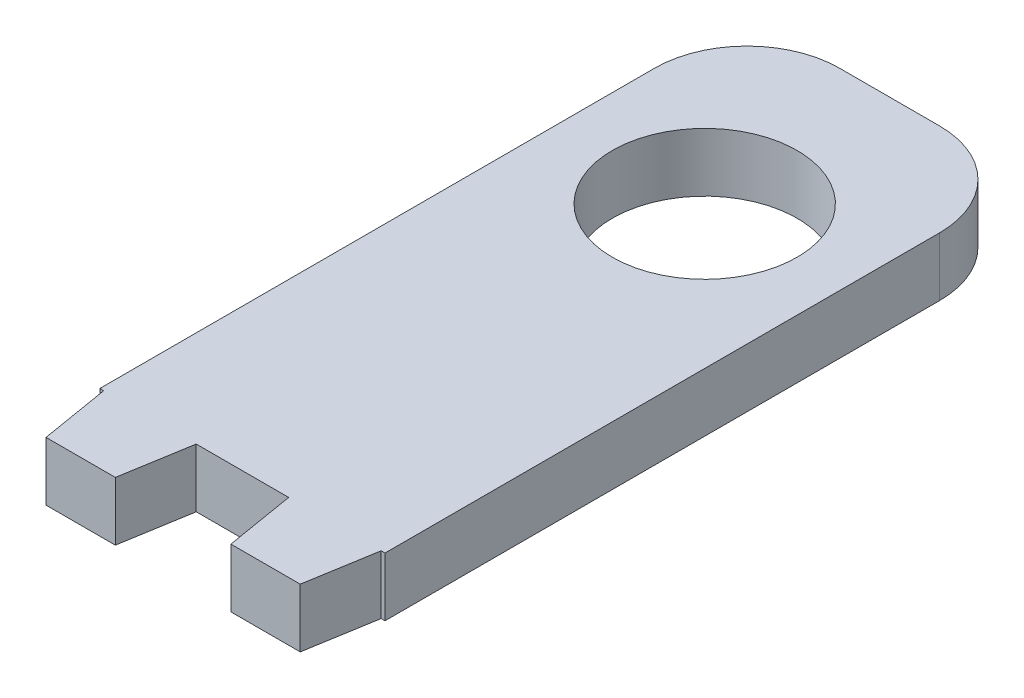
ISO-10303-21;
HEADER;
FILE_DESCRIPTION(('STEP AP214'),'2;1');
FILE_NAME('part.step','',(''),(''),'','','');
FILE_SCHEMA(('AUTOMOTIVE_DESIGN { 1 0 10303 214 1 1 1 1 }'));
ENDSEC;
DATA;
#1=APPLICATION_CONTEXT('core data for automotive mechanical design processes');
#2=APPLICATION_PROTOCOL_DEFINITION('international standard','automotive_design',2000,#1);
#3=PRODUCT_CONTEXT('',#1,'mechanical');
#4=PRODUCT('Part','Part','',(#3));
#5=PRODUCT_RELATED_PRODUCT_CATEGORY('part','',(#4));
#6=PRODUCT_DEFINITION_FORMATION('','',#4);
#7=PRODUCT_DEFINITION_CONTEXT('part definition',#1,'design');
#8=PRODUCT_DEFINITION('design','',#6,#7);
#9=PRODUCT_DEFINITION_SHAPE('','',#8);
#10=(LENGTH_UNIT() NAMED_UNIT(*) SI_UNIT(.MILLI.,.METRE.));
#11=(NAMED_UNIT(*) PLANE_ANGLE_UNIT() SI_UNIT($,.RADIAN.));
#12=(NAMED_UNIT(*) SI_UNIT($,.STERADIAN.) SOLID_ANGLE_UNIT());
#13=UNCERTAINTY_MEASURE_WITH_UNIT(LENGTH_MEASURE(1.E-05),#10,'distance_accuracy_value','');
#14=(GEOMETRIC_REPRESENTATION_CONTEXT(3) GLOBAL_UNCERTAINTY_ASSIGNED_CONTEXT((#13)) GLOBAL_UNIT_ASSIGNED_CONTEXT((#10,
#11,#12)) REPRESENTATION_CONTEXT('',''));
#15=CARTESIAN_POINT('',(0.,0.,0.));
#16=DIRECTION('',(0.,0.,1.));
#17=DIRECTION('',(1.,0.,0.));
#18=AXIS2_PLACEMENT_3D('',#15,#16,#17);
#19=CARTESIAN_POINT('',(20.2702702702703,6.35,3.37837837837838));
#20=DIRECTION('',(0.986393923832144,0.,0.164398987305357));
#21=DIRECTION('',(0.164398987305357,0.,-0.986393923832144));
#22=AXIS2_PLACEMENT_3D('',#19,#20,#21);
#23=PLANE('',#22);
#24=DIRECTION('',(-0.164398987305357,0.,0.986393923832144));
#25=VECTOR('',#24,1.);
#26=CARTESIAN_POINT('',(20.2702702702703,0.,3.37837837837838));
#27=LINE('',#26,#25);
#28=CARTESIAN_POINT('',(15.,0.,35.));
#29=VERTEX_POINT('',#28);
#30=CARTESIAN_POINT('',(13.75,0.,42.5));
#31=VERTEX_POINT('',#30);
#32=EDGE_CURVE('E141',#29,#31,#27,.T.);
#33=ORIENTED_EDGE('',*,*,#32,.F.);
#34=DIRECTION('',(0.,-1.,0.));
#35=VECTOR('',#34,1.);
#36=CARTESIAN_POINT('',(15.,6.35,35.));
#37=LINE('',#36,#35);
#38=CARTESIAN_POINT('',(15.,6.35,35.));
#39=VERTEX_POINT('',#38);
#40=EDGE_CURVE('E135',#39,#29,#37,.T.);
#41=ORIENTED_EDGE('',*,*,#40,.F.);
#42=DIRECTION('',(-0.164398987305357,0.,0.986393923832144));
#43=VECTOR('',#42,1.);
#44=CARTESIAN_POINT('',(20.2702702702703,6.35,3.37837837837838));
#45=LINE('',#44,#43);
#46=CARTESIAN_POINT('',(13.75,6.35,42.5));
#47=VERTEX_POINT('',#46);
#48=EDGE_CURVE('E138',#39,#47,#45,.T.);
#49=ORIENTED_EDGE('',*,*,#48,.T.);
#50=DIRECTION('',(0.,-1.,0.));
#51=VECTOR('',#50,1.);
#52=CARTESIAN_POINT('',(13.75,6.35,42.5));
#53=LINE('',#52,#51);
#54=EDGE_CURVE('E185',#47,#31,#53,.T.);
#55=ORIENTED_EDGE('',*,*,#54,.T.);
#56=EDGE_LOOP('',(#33,#41,#49,#55));
#57=FACE_BOUND('',#56,.T.);
#58=ADVANCED_FACE('F34',(#57),#23,.T.);
#59=CARTESIAN_POINT('',(0.,6.35,35.));
#60=DIRECTION('',(0.,0.,-1.));
#61=DIRECTION('',(-1.,0.,0.));
#62=AXIS2_PLACEMENT_3D('',#59,#60,#61);
#63=PLANE('',#62);
#64=DIRECTION('',(1.,0.,0.));
#65=VECTOR('',#64,1.);
#66=CARTESIAN_POINT('',(0.,0.,35.));
#67=LINE('',#66,#65);
#68=CARTESIAN_POINT('',(15.4183643849684,0.,35.));
#69=VERTEX_POINT('',#68);
#70=EDGE_CURVE('E187',#29,#69,#67,.T.);
#71=ORIENTED_EDGE('',*,*,#70,.T.);
#72=DIRECTION('',(0.,-1.,0.));
#73=VECTOR('',#72,1.);
#74=CARTESIAN_POINT('',(15.4183643849684,6.35,35.));
#75=LINE('',#74,#73);
#76=CARTESIAN_POINT('',(15.4183643849684,6.35,35.));
#77=VERTEX_POINT('',#76);
#78=EDGE_CURVE('E146',#77,#69,#75,.T.);
#79=ORIENTED_EDGE('',*,*,#78,.F.);
#80=DIRECTION('',(1.,0.,0.));
#81=VECTOR('',#80,1.);
#82=CARTESIAN_POINT('',(0.,6.35,35.));
#83=LINE('',#82,#81);
#84=EDGE_CURVE('E150',#39,#77,#83,.T.);
#85=ORIENTED_EDGE('',*,*,#84,.F.);
#86=ORIENTED_EDGE('',*,*,#40,.T.);
#87=EDGE_LOOP('',(#71,#79,#85,#86));
#88=FACE_BOUND('',#87,.T.);
#89=ADVANCED_FACE('F151',(#88),#63,.F.);
#90=CARTESIAN_POINT('',(15.4183643849683,6.35,0.));
#91=DIRECTION('',(1.,0.,0.));
#92=DIRECTION('',(0.,0.,-1.));
#93=AXIS2_PLACEMENT_3D('',#90,#91,#92);
#94=PLANE('',#93);
#95=DIRECTION('',(0.,0.,1.));
#96=VECTOR('',#95,1.);
#97=CARTESIAN_POINT('',(15.4183643849683,0.,0.));
#98=LINE('',#97,#96);
#99=CARTESIAN_POINT('',(15.4183643849683,0.,-25.));
#100=VERTEX_POINT('',#99);
#101=EDGE_CURVE('E189',#100,#69,#98,.T.);
#102=ORIENTED_EDGE('',*,*,#101,.F.);
#103=DIRECTION('',(0.,-1.,0.));
#104=VECTOR('',#103,1.);
#105=CARTESIAN_POINT('',(15.4183643849683,6.35,-25.));
#106=LINE('',#105,#104);
#107=CARTESIAN_POINT('',(15.4183643849683,6.35,-25.));
#108=VERTEX_POINT('',#107);
#109=EDGE_CURVE('E11',#100,#108,#106,.F.);
#110=ORIENTED_EDGE('',*,*,#109,.T.);
#111=DIRECTION('',(0.,0.,1.));
#112=VECTOR('',#111,1.);
#113=CARTESIAN_POINT('',(15.4183643849683,6.35,0.));
#114=LINE('',#113,#112);
#115=EDGE_CURVE('E153',#108,#77,#114,.T.);
#116=ORIENTED_EDGE('',*,*,#115,.T.);
#117=ORIENTED_EDGE('',*,*,#78,.T.);
#118=EDGE_LOOP('',(#102,#110,#116,#117));
#119=FACE_BOUND('',#118,.T.);
#120=ADVANCED_FACE('F262',(#119),#94,.T.);
#121=CARTESIAN_POINT('',(0.,6.35,-35.));
#122=DIRECTION('',(0.,0.,-1.));
#123=DIRECTION('',(-1.,0.,0.));
#124=AXIS2_PLACEMENT_3D('',#121,#122,#123);
#125=PLANE('',#124);
#126=DIRECTION('',(1.,0.,0.));
#127=VECTOR('',#126,1.);
#128=CARTESIAN_POINT('',(0.,0.,-35.));
#129=LINE('',#128,#127);
#130=CARTESIAN_POINT('',(-5.41836438496835,0.,-35.));
#131=VERTEX_POINT('',#130);
#132=CARTESIAN_POINT('',(5.41836438496835,0.,-35.));
#133=VERTEX_POINT('',#132);
#134=EDGE_CURVE('E193',#131,#133,#129,.T.);
#135=ORIENTED_EDGE('',*,*,#134,.F.);
#136=DIRECTION('',(0.,-1.,0.));
#137=VECTOR('',#136,1.);
#138=CARTESIAN_POINT('',(-5.41836438496835,6.35,-35.));
#139=LINE('',#138,#137);
#140=CARTESIAN_POINT('',(-5.41836438496835,6.35,-35.));
#141=VERTEX_POINT('',#140);
#142=EDGE_CURVE('E240',#131,#141,#139,.F.);
#143=ORIENTED_EDGE('',*,*,#142,.T.);
#144=DIRECTION('',(1.,0.,0.));
#145=VECTOR('',#144,1.);
#146=CARTESIAN_POINT('',(0.,6.35,-35.));
#147=LINE('',#146,#145);
#148=CARTESIAN_POINT('',(5.41836438496835,6.35,-35.));
#149=VERTEX_POINT('',#148);
#150=EDGE_CURVE('E168',#141,#149,#147,.T.);
#151=ORIENTED_EDGE('',*,*,#150,.T.);
#152=DIRECTION('',(0.,-1.,0.));
#153=VECTOR('',#152,1.);
#154=CARTESIAN_POINT('',(5.41836438496835,6.35,-35.));
#155=LINE('',#154,#153);
#156=EDGE_CURVE('E237',#149,#133,#155,.T.);
#157=ORIENTED_EDGE('',*,*,#156,.T.);
#158=EDGE_LOOP('',(#135,#143,#151,#157));
#159=FACE_BOUND('',#158,.T.);
#160=ADVANCED_FACE('F259',(#159),#125,.T.);
#161=CARTESIAN_POINT('',(-15.4183643849683,6.35,0.));
#162=DIRECTION('',(1.,0.,0.));
#163=DIRECTION('',(0.,0.,-1.));
#164=AXIS2_PLACEMENT_3D('',#161,#162,#163);
#165=PLANE('',#164);
#166=DIRECTION('',(0.,0.,1.));
#167=VECTOR('',#166,1.);
#168=CARTESIAN_POINT('',(-15.4183643849683,6.35,0.));
#169=LINE('',#168,#167);
#170=CARTESIAN_POINT('',(-15.4183643849684,6.35,-25.));
#171=VERTEX_POINT('',#170);
#172=CARTESIAN_POINT('',(-15.4183643849683,6.35,35.));
#173=VERTEX_POINT('',#172);
#174=EDGE_CURVE('E170',#171,#173,#169,.T.);
#175=ORIENTED_EDGE('',*,*,#174,.F.);
#176=DIRECTION('',(0.,-1.,0.));
#177=VECTOR('',#176,1.);
#178=CARTESIAN_POINT('',(-15.4183643849684,0.,-25.));
#179=LINE('',#178,#177);
#180=CARTESIAN_POINT('',(-15.4183643849684,0.,-25.));
#181=VERTEX_POINT('',#180);
#182=EDGE_CURVE('E145',#171,#181,#179,.T.);
#183=ORIENTED_EDGE('',*,*,#182,.T.);
#184=DIRECTION('',(0.,0.,1.));
#185=VECTOR('',#184,1.);
#186=CARTESIAN_POINT('',(-15.4183643849683,0.,0.));
#187=LINE('',#186,#185);
#188=CARTESIAN_POINT('',(-15.4183643849683,0.,35.));
#189=VERTEX_POINT('',#188);
#190=EDGE_CURVE('E196',#181,#189,#187,.T.);
#191=ORIENTED_EDGE('',*,*,#190,.T.);
#192=DIRECTION('',(0.,-1.,0.));
#193=VECTOR('',#192,1.);
#194=CARTESIAN_POINT('',(-15.4183643849683,6.35,35.));
#195=LINE('',#194,#193);
#196=EDGE_CURVE('E227',#173,#189,#195,.T.);
#197=ORIENTED_EDGE('',*,*,#196,.F.);
#198=EDGE_LOOP('',(#175,#183,#191,#197));
#199=FACE_BOUND('',#198,.T.);
#200=ADVANCED_FACE('F249',(#199),#165,.F.);
#201=CARTESIAN_POINT('',(-15.,0.,35.));
#202=VERTEX_POINT('',#201);
#203=EDGE_CURVE('E191',#189,#202,#67,.T.);
#204=ORIENTED_EDGE('',*,*,#203,.T.);
#205=DIRECTION('',(0.,-1.,0.));
#206=VECTOR('',#205,1.);
#207=CARTESIAN_POINT('',(-15.,6.35,35.));
#208=LINE('',#207,#206);
#209=CARTESIAN_POINT('',(-15.,6.35,35.));
#210=VERTEX_POINT('',#209);
#211=EDGE_CURVE('E224',#210,#202,#208,.T.);
#212=ORIENTED_EDGE('',*,*,#211,.F.);
#213=EDGE_CURVE('E156',#173,#210,#83,.T.);
#214=ORIENTED_EDGE('',*,*,#213,.F.);
#215=ORIENTED_EDGE('',*,*,#196,.T.);
#216=EDGE_LOOP('',(#204,#212,#214,#215));
#217=FACE_BOUND('',#216,.T.);
#218=ADVANCED_FACE('F291',(#217),#63,.F.);
#219=CARTESIAN_POINT('',(-20.2702702702703,6.35,3.37837837837843));
#220=DIRECTION('',(0.986393923832143,0.,-0.164398987305359));
#221=DIRECTION('',(-0.164398987305359,0.,-0.986393923832144));
#222=AXIS2_PLACEMENT_3D('',#219,#220,#221);
#223=PLANE('',#222);
#224=DIRECTION('',(0.164398987305359,0.,0.986393923832143));
#225=VECTOR('',#224,1.);
#226=CARTESIAN_POINT('',(-20.2702702702703,0.,3.37837837837843));
#227=LINE('',#226,#225);
#228=CARTESIAN_POINT('',(-13.75,0.,42.5));
#229=VERTEX_POINT('',#228);
#230=EDGE_CURVE('E198',#202,#229,#227,.T.);
#231=ORIENTED_EDGE('',*,*,#230,.T.);
#232=DIRECTION('',(0.,-1.,0.));
#233=VECTOR('',#232,1.);
#234=CARTESIAN_POINT('',(-13.75,6.35,42.5));
#235=LINE('',#234,#233);
#236=CARTESIAN_POINT('',(-13.75,6.35,42.5));
#237=VERTEX_POINT('',#236);
#238=EDGE_CURVE('E221',#237,#229,#235,.T.);
#239=ORIENTED_EDGE('',*,*,#238,.F.);
#240=DIRECTION('',(0.164398987305359,0.,0.986393923832143));
#241=VECTOR('',#240,1.);
#242=CARTESIAN_POINT('',(-20.2702702702703,6.35,3.37837837837843));
#243=LINE('',#242,#241);
#244=EDGE_CURVE('E172',#210,#237,#243,.T.);
#245=ORIENTED_EDGE('',*,*,#244,.F.);
#246=ORIENTED_EDGE('',*,*,#211,.T.);
#247=EDGE_LOOP('',(#231,#239,#245,#246));
#248=FACE_BOUND('',#247,.T.);
#249=ADVANCED_FACE('F287',(#248),#223,.F.);
#250=CARTESIAN_POINT('',(0.,6.35,42.5));
#251=DIRECTION('',(0.,0.,-1.));
#252=DIRECTION('',(-1.,0.,0.));
#253=AXIS2_PLACEMENT_3D('',#250,#251,#252);
#254=PLANE('',#253);
#255=DIRECTION('',(1.,0.,0.));
#256=VECTOR('',#255,1.);
#257=CARTESIAN_POINT('',(0.,0.,42.5));
#258=LINE('',#257,#256);
#259=CARTESIAN_POINT('',(-6.24999999999999,0.,42.5));
#260=VERTEX_POINT('',#259);
#261=EDGE_CURVE('E200',#229,#260,#258,.T.);
#262=ORIENTED_EDGE('',*,*,#261,.T.);
#263=DIRECTION('',(0.,-1.,0.));
#264=VECTOR('',#263,1.);
#265=CARTESIAN_POINT('',(-6.24999999999999,6.35,42.5));
#266=LINE('',#265,#264);
#267=CARTESIAN_POINT('',(-6.24999999999999,6.35,42.5));
#268=VERTEX_POINT('',#267);
#269=EDGE_CURVE('E219',#268,#260,#266,.T.);
#270=ORIENTED_EDGE('',*,*,#269,.F.);
#271=DIRECTION('',(1.,0.,0.));
#272=VECTOR('',#271,1.);
#273=CARTESIAN_POINT('',(0.,6.35,42.5));
#274=LINE('',#273,#272);
#275=EDGE_CURVE('E174',#237,#268,#274,.T.);
#276=ORIENTED_EDGE('',*,*,#275,.F.);
#277=ORIENTED_EDGE('',*,*,#238,.T.);
#278=EDGE_LOOP('',(#262,#270,#276,#277));
#279=FACE_BOUND('',#278,.T.);
#280=ADVANCED_FACE('F283',(#279),#254,.F.);
#281=CARTESIAN_POINT('',(0.810810810810726,6.35,0.135135135135119));
#282=DIRECTION('',(0.986393923832144,0.,0.164398987305355));
#283=DIRECTION('',(0.164398987305355,0.,-0.986393923832144));
#284=AXIS2_PLACEMENT_3D('',#281,#282,#283);
#285=PLANE('',#284);
#286=DIRECTION('',(-0.164398987305355,0.,0.986393923832144));
#287=VECTOR('',#286,1.);
#288=CARTESIAN_POINT('',(0.810810810810726,0.,0.135135135135119));
#289=LINE('',#288,#287);
#290=CARTESIAN_POINT('',(-5.,0.,35.));
#291=VERTEX_POINT('',#290);
#292=EDGE_CURVE('E203',#291,#260,#289,.T.);
#293=ORIENTED_EDGE('',*,*,#292,.F.);
#294=DIRECTION('',(0.,-1.,0.));
#295=VECTOR('',#294,1.);
#296=CARTESIAN_POINT('',(-5.,6.35,35.));
#297=LINE('',#296,#295);
#298=CARTESIAN_POINT('',(-5.,6.35,35.));
#299=VERTEX_POINT('',#298);
#300=EDGE_CURVE('E217',#299,#291,#297,.T.);
#301=ORIENTED_EDGE('',*,*,#300,.F.);
#302=DIRECTION('',(-0.164398987305355,0.,0.986393923832144));
#303=VECTOR('',#302,1.);
#304=CARTESIAN_POINT('',(0.810810810810726,6.35,0.135135135135119));
#305=LINE('',#304,#303);
#306=EDGE_CURVE('E176',#299,#268,#305,.T.);
#307=ORIENTED_EDGE('',*,*,#306,.T.);
#308=ORIENTED_EDGE('',*,*,#269,.T.);
#309=EDGE_LOOP('',(#293,#301,#307,#308));
#310=FACE_BOUND('',#309,.T.);
#311=ADVANCED_FACE('F277',(#310),#285,.T.);
#312=CARTESIAN_POINT('',(4.99999999999999,0.,35.));
#313=VERTEX_POINT('',#312);
#314=EDGE_CURVE('E190',#291,#313,#67,.T.);
#315=ORIENTED_EDGE('',*,*,#314,.T.);
#316=DIRECTION('',(0.,-1.,0.));
#317=VECTOR('',#316,1.);
#318=CARTESIAN_POINT('',(4.99999999999999,6.35,35.));
#319=LINE('',#318,#317);
#320=CARTESIAN_POINT('',(4.99999999999999,6.35,35.));
#321=VERTEX_POINT('',#320);
#322=EDGE_CURVE('E214',#321,#313,#319,.T.);
#323=ORIENTED_EDGE('',*,*,#322,.F.);
#324=EDGE_CURVE('E155',#299,#321,#83,.T.);
#325=ORIENTED_EDGE('',*,*,#324,.F.);
#326=ORIENTED_EDGE('',*,*,#300,.T.);
#327=EDGE_LOOP('',(#315,#323,#325,#326));
#328=FACE_BOUND('',#327,.T.);
#329=ADVANCED_FACE('F292',(#328),#63,.F.);
#330=CARTESIAN_POINT('',(-0.810810810810829,6.35,0.135135135135139));
#331=DIRECTION('',(0.986393923832144,0.,-0.164398987305358));
#332=DIRECTION('',(-0.164398987305358,0.,-0.986393923832144));
#333=AXIS2_PLACEMENT_3D('',#330,#331,#332);
#334=PLANE('',#333);
#335=DIRECTION('',(0.164398987305358,0.,0.986393923832144));
#336=VECTOR('',#335,1.);
#337=CARTESIAN_POINT('',(-0.810810810810829,0.,0.135135135135139));
#338=LINE('',#337,#336);
#339=CARTESIAN_POINT('',(6.25,0.,42.5));
#340=VERTEX_POINT('',#339);
#341=EDGE_CURVE('E206',#313,#340,#338,.T.);
#342=ORIENTED_EDGE('',*,*,#341,.T.);
#343=DIRECTION('',(0.,-1.,0.));
#344=VECTOR('',#343,1.);
#345=CARTESIAN_POINT('',(6.25,6.35,42.5));
#346=LINE('',#345,#344);
#347=CARTESIAN_POINT('',(6.25,6.35,42.5));
#348=VERTEX_POINT('',#347);
#349=EDGE_CURVE('E212',#348,#340,#346,.T.);
#350=ORIENTED_EDGE('',*,*,#349,.F.);
#351=DIRECTION('',(0.164398987305358,0.,0.986393923832144));
#352=VECTOR('',#351,1.);
#353=CARTESIAN_POINT('',(-0.810810810810829,6.35,0.135135135135139));
#354=LINE('',#353,#352);
#355=EDGE_CURVE('E179',#321,#348,#354,.T.);
#356=ORIENTED_EDGE('',*,*,#355,.F.);
#357=ORIENTED_EDGE('',*,*,#322,.T.);
#358=EDGE_LOOP('',(#342,#350,#356,#357));
#359=FACE_BOUND('',#358,.T.);
#360=ADVANCED_FACE('F270',(#359),#334,.F.);
#361=CARTESIAN_POINT('',(0.,6.35,42.5));
#362=DIRECTION('',(0.,0.,1.));
#363=DIRECTION('',(1.,0.,0.));
#364=AXIS2_PLACEMENT_3D('',#361,#362,#363);
#365=PLANE('',#364);
#366=DIRECTION('',(-1.,0.,0.));
#367=VECTOR('',#366,1.);
#368=CARTESIAN_POINT('',(0.,0.,42.5));
#369=LINE('',#368,#367);
#370=EDGE_CURVE('E164',#31,#340,#369,.T.);
#371=ORIENTED_EDGE('',*,*,#370,.F.);
#372=ORIENTED_EDGE('',*,*,#54,.F.);
#373=DIRECTION('',(-1.,0.,0.));
#374=VECTOR('',#373,1.);
#375=CARTESIAN_POINT('',(0.,6.35,42.5));
#376=LINE('',#375,#374);
#377=EDGE_CURVE('E160',#47,#348,#376,.T.);
#378=ORIENTED_EDGE('',*,*,#377,.T.);
#379=ORIENTED_EDGE('',*,*,#349,.T.);
#380=EDGE_LOOP('',(#371,#372,#378,#379));
#381=FACE_BOUND('',#380,.T.);
#382=ADVANCED_FACE('F266',(#381),#365,.T.);
#383=CARTESIAN_POINT('',(0.,6.35,-15.));
#384=DIRECTION('',(0.,-1.,0.));
#385=DIRECTION('',(0.,0.,-1.));
#386=AXIS2_PLACEMENT_3D('',#383,#384,#385);
#387=CYLINDRICAL_SURFACE('',#386,10.);
#388=CARTESIAN_POINT('',(0.,6.35,-15.));
#389=DIRECTION('',(0.,1.,0.));
#390=DIRECTION('',(0.,0.,1.));
#391=AXIS2_PLACEMENT_3D('',#388,#389,#390);
#392=CIRCLE('',#391,10.);
#393=CARTESIAN_POINT('',(0.,6.35,-4.99999999999999));
#394=VERTEX_POINT('',#393);
#395=EDGE_CURVE('E182',#394,#394,#392,.T.);
#396=ORIENTED_EDGE('',*,*,#395,.T.);
#397=EDGE_LOOP('',(#396));
#398=FACE_BOUND('',#397,.T.);
#399=CARTESIAN_POINT('',(0.,0.,-15.));
#400=DIRECTION('',(0.,1.,0.));
#401=DIRECTION('',(0.,0.,1.));
#402=AXIS2_PLACEMENT_3D('',#399,#400,#401);
#403=CIRCLE('',#402,10.);
#404=CARTESIAN_POINT('',(0.,0.,-4.99999999999999));
#405=VERTEX_POINT('',#404);
#406=EDGE_CURVE('E161',#405,#405,#403,.T.);
#407=ORIENTED_EDGE('',*,*,#406,.F.);
#408=EDGE_LOOP('',(#407));
#409=FACE_BOUND('',#408,.T.);
#410=ADVANCED_FACE('F318',(#398,#409),#387,.F.);
#411=CARTESIAN_POINT('',(0.,6.35,0.));
#412=DIRECTION('',(0.,1.,0.));
#413=DIRECTION('',(0.,0.,1.));
#414=AXIS2_PLACEMENT_3D('',#411,#412,#413);
#415=PLANE('',#414);
#416=ORIENTED_EDGE('',*,*,#150,.F.);
#417=CARTESIAN_POINT('',(-5.41836438496835,6.35,-25.));
#418=DIRECTION('',(0.,1.,0.));
#419=DIRECTION('',(0.,0.,1.));
#420=AXIS2_PLACEMENT_3D('',#417,#418,#419);
#421=CIRCLE('',#420,10.);
#422=EDGE_CURVE('E42',#141,#171,#421,.T.);
#423=ORIENTED_EDGE('',*,*,#422,.T.);
#424=ORIENTED_EDGE('',*,*,#174,.T.);
#425=ORIENTED_EDGE('',*,*,#213,.T.);
#426=ORIENTED_EDGE('',*,*,#244,.T.);
#427=ORIENTED_EDGE('',*,*,#275,.T.);
#428=ORIENTED_EDGE('',*,*,#306,.F.);
#429=ORIENTED_EDGE('',*,*,#324,.T.);
#430=ORIENTED_EDGE('',*,*,#355,.T.);
#431=ORIENTED_EDGE('',*,*,#377,.F.);
#432=ORIENTED_EDGE('',*,*,#48,.F.);
#433=ORIENTED_EDGE('',*,*,#84,.T.);
#434=ORIENTED_EDGE('',*,*,#115,.F.);
#435=CARTESIAN_POINT('',(5.41836438496835,6.35,-25.));
#436=DIRECTION('',(0.,1.,0.));
#437=DIRECTION('',(0.,0.,1.));
#438=AXIS2_PLACEMENT_3D('',#435,#436,#437);
#439=CIRCLE('',#438,10.);
#440=EDGE_CURVE('E54',#108,#149,#439,.T.);
#441=ORIENTED_EDGE('',*,*,#440,.T.);
#442=EDGE_LOOP('',(#416,#423,#424,#425,#426,#427,#428,#429,#430,#431,#432,#433,#434,#441));
#443=FACE_BOUND('',#442,.T.);
#444=ORIENTED_EDGE('',*,*,#395,.F.);
#445=EDGE_LOOP('',(#444));
#446=FACE_BOUND('',#445,.T.);
#447=ADVANCED_FACE('F157',(#443,#446),#415,.T.);
#448=CARTESIAN_POINT('',(0.,0.,0.));
#449=DIRECTION('',(0.,1.,0.));
#450=DIRECTION('',(0.,0.,1.));
#451=AXIS2_PLACEMENT_3D('',#448,#449,#450);
#452=PLANE('',#451);
#453=ORIENTED_EDGE('',*,*,#190,.F.);
#454=CARTESIAN_POINT('',(-5.41836438496835,0.,-25.));
#455=DIRECTION('',(0.,1.,0.));
#456=DIRECTION('',(0.,0.,1.));
#457=AXIS2_PLACEMENT_3D('',#454,#455,#456);
#458=CIRCLE('',#457,10.);
#459=EDGE_CURVE('E235',#181,#131,#458,.F.);
#460=ORIENTED_EDGE('',*,*,#459,.T.);
#461=ORIENTED_EDGE('',*,*,#134,.T.);
#462=CARTESIAN_POINT('',(5.41836438496835,0.,-25.));
#463=DIRECTION('',(0.,1.,0.));
#464=DIRECTION('',(0.,0.,1.));
#465=AXIS2_PLACEMENT_3D('',#462,#463,#464);
#466=CIRCLE('',#465,10.);
#467=EDGE_CURVE('E233',#133,#100,#466,.F.);
#468=ORIENTED_EDGE('',*,*,#467,.T.);
#469=ORIENTED_EDGE('',*,*,#101,.T.);
#470=ORIENTED_EDGE('',*,*,#70,.F.);
#471=ORIENTED_EDGE('',*,*,#32,.T.);
#472=ORIENTED_EDGE('',*,*,#370,.T.);
#473=ORIENTED_EDGE('',*,*,#341,.F.);
#474=ORIENTED_EDGE('',*,*,#314,.F.);
#475=ORIENTED_EDGE('',*,*,#292,.T.);
#476=ORIENTED_EDGE('',*,*,#261,.F.);
#477=ORIENTED_EDGE('',*,*,#230,.F.);
#478=ORIENTED_EDGE('',*,*,#203,.F.);
#479=EDGE_LOOP('',(#453,#460,#461,#468,#469,#470,#471,#472,#473,#474,#475,#476,#477,#478));
#480=FACE_BOUND('',#479,.T.);
#481=ORIENTED_EDGE('',*,*,#406,.T.);
#482=EDGE_LOOP('',(#481));
#483=FACE_BOUND('',#482,.T.);
#484=ADVANCED_FACE('F255',(#480,#483),#452,.F.);
#485=CARTESIAN_POINT('',(-5.41836438496835,6.35,-25.));
#486=DIRECTION('',(0.,1.,0.));
#487=DIRECTION('',(0.,0.,1.));
#488=AXIS2_PLACEMENT_3D('',#485,#486,#487);
#489=CYLINDRICAL_SURFACE('',#488,10.);
#490=ORIENTED_EDGE('',*,*,#422,.F.);
#491=ORIENTED_EDGE('',*,*,#142,.F.);
#492=ORIENTED_EDGE('',*,*,#459,.F.);
#493=ORIENTED_EDGE('',*,*,#182,.F.);
#494=EDGE_LOOP('',(#490,#491,#492,#493));
#495=FACE_BOUND('',#494,.T.);
#496=ADVANCED_FACE('F252',(#495),#489,.T.);
#497=CARTESIAN_POINT('',(5.41836438496835,6.35,-25.));
#498=DIRECTION('',(0.,-1.,0.));
#499=DIRECTION('',(0.,0.,-1.));
#500=AXIS2_PLACEMENT_3D('',#497,#498,#499);
#501=CYLINDRICAL_SURFACE('',#500,10.);
#502=ORIENTED_EDGE('',*,*,#440,.F.);
#503=ORIENTED_EDGE('',*,*,#109,.F.);
#504=ORIENTED_EDGE('',*,*,#467,.F.);
#505=ORIENTED_EDGE('',*,*,#156,.F.);
#506=EDGE_LOOP('',(#502,#503,#504,#505));
#507=FACE_BOUND('',#506,.T.);
#508=ADVANCED_FACE('F36',(#507),#501,.T.);
#509=CLOSED_SHELL('',(#58,#89,#120,#160,#200,#218,#249,#280,#311,#329,#360,#382,#410,#447,#484,
#496,#508));
#510=MANIFOLD_SOLID_BREP('B2',#509);
#511=ADVANCED_BREP_SHAPE_REPRESENTATION('',(#18,#510),#14);
#512=SHAPE_DEFINITION_REPRESENTATION(#9,#511);
ENDSEC;
END-ISO-10303-21;
